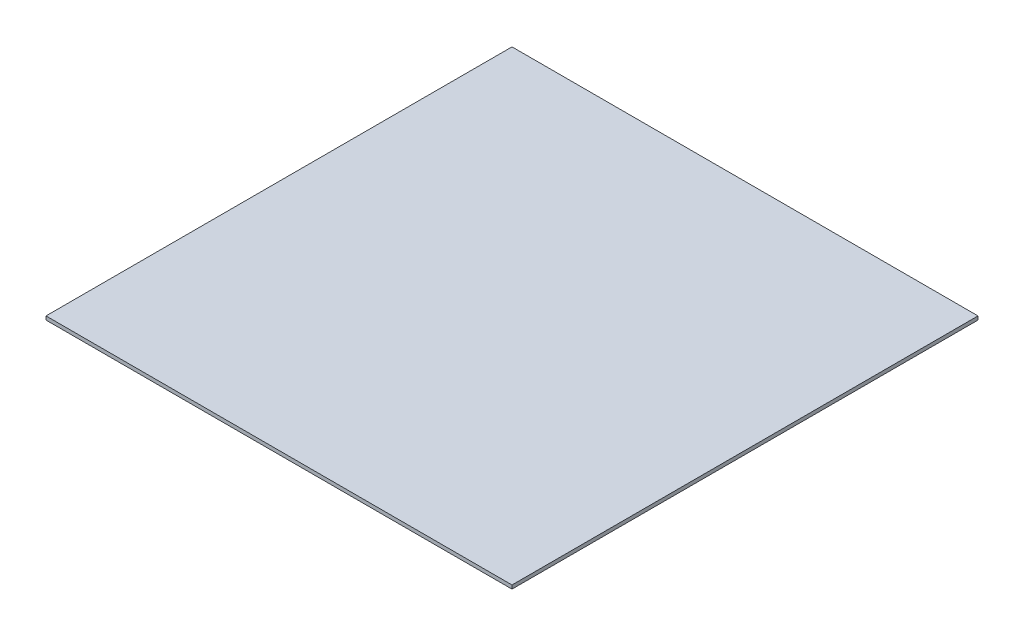
ISO-10303-21;
HEADER;
FILE_DESCRIPTION(('STEP AP214'),'2;1');
FILE_NAME('part.step','',(''),(''),'','','');
FILE_SCHEMA(('AUTOMOTIVE_DESIGN { 1 0 10303 214 1 1 1 1 }'));
ENDSEC;
DATA;
#1=APPLICATION_CONTEXT('core data for automotive mechanical design processes');
#2=APPLICATION_PROTOCOL_DEFINITION('international standard','automotive_design',2000,#1);
#3=PRODUCT_CONTEXT('',#1,'mechanical');
#4=PRODUCT('Part','Part','',(#3));
#5=PRODUCT_RELATED_PRODUCT_CATEGORY('part','',(#4));
#6=PRODUCT_DEFINITION_FORMATION('','',#4);
#7=PRODUCT_DEFINITION_CONTEXT('part definition',#1,'design');
#8=PRODUCT_DEFINITION('design','',#6,#7);
#9=PRODUCT_DEFINITION_SHAPE('','',#8);
#10=(LENGTH_UNIT() NAMED_UNIT(*) SI_UNIT(.MILLI.,.METRE.));
#11=(NAMED_UNIT(*) PLANE_ANGLE_UNIT() SI_UNIT($,.RADIAN.));
#12=(NAMED_UNIT(*) SI_UNIT($,.STERADIAN.) SOLID_ANGLE_UNIT());
#13=UNCERTAINTY_MEASURE_WITH_UNIT(LENGTH_MEASURE(1.E-05),#10,'distance_accuracy_value','');
#14=(GEOMETRIC_REPRESENTATION_CONTEXT(3) GLOBAL_UNCERTAINTY_ASSIGNED_CONTEXT((#13)) GLOBAL_UNIT_ASSIGNED_CONTEXT((#10,
#11,#12)) REPRESENTATION_CONTEXT('',''));
#15=CARTESIAN_POINT('',(0.,0.,0.));
#16=DIRECTION('',(0.,0.,1.));
#17=DIRECTION('',(1.,0.,0.));
#18=AXIS2_PLACEMENT_3D('',#15,#16,#17);
#19=CARTESIAN_POINT('',(640.638743755012,10.,640.638743755012));
#20=DIRECTION('',(-1.,0.,0.));
#21=DIRECTION('',(0.,0.,1.));
#22=AXIS2_PLACEMENT_3D('',#19,#20,#21);
#23=PLANE('',#22);
#24=DIRECTION('',(0.,0.,-1.));
#25=VECTOR('',#24,1.);
#26=CARTESIAN_POINT('',(640.638743755012,0.,640.638743755012));
#27=LINE('',#26,#25);
#28=CARTESIAN_POINT('',(640.638743755012,0.,640.638743755012));
#29=VERTEX_POINT('',#28);
#30=CARTESIAN_POINT('',(640.638743755012,0.,-640.638743755012));
#31=VERTEX_POINT('',#30);
#32=EDGE_CURVE('E98',#29,#31,#27,.T.);
#33=ORIENTED_EDGE('',*,*,#32,.T.);
#34=DIRECTION('',(0.,-1.,0.));
#35=VECTOR('',#34,1.);
#36=CARTESIAN_POINT('',(640.638743755012,10.,-640.638743755012));
#37=LINE('',#36,#35);
#38=CARTESIAN_POINT('',(640.638743755012,10.,-640.638743755012));
#39=VERTEX_POINT('',#38);
#40=EDGE_CURVE('E11',#39,#31,#37,.T.);
#41=ORIENTED_EDGE('',*,*,#40,.F.);
#42=DIRECTION('',(0.,0.,-1.));
#43=VECTOR('',#42,1.);
#44=CARTESIAN_POINT('',(640.638743755012,10.,640.638743755012));
#45=LINE('',#44,#43);
#46=CARTESIAN_POINT('',(640.638743755012,10.,640.638743755012));
#47=VERTEX_POINT('',#46);
#48=EDGE_CURVE('E86',#47,#39,#45,.T.);
#49=ORIENTED_EDGE('',*,*,#48,.F.);
#50=DIRECTION('',(0.,-1.,0.));
#51=VECTOR('',#50,1.);
#52=CARTESIAN_POINT('',(640.638743755012,10.,640.638743755012));
#53=LINE('',#52,#51);
#54=EDGE_CURVE('E94',#47,#29,#53,.T.);
#55=ORIENTED_EDGE('',*,*,#54,.T.);
#56=EDGE_LOOP('',(#33,#41,#49,#55));
#57=FACE_BOUND('',#56,.T.);
#58=ADVANCED_FACE('F35',(#57),#23,.F.);
#59=CARTESIAN_POINT('',(640.638743755012,10.,-640.638743755012));
#60=DIRECTION('',(0.,0.,1.));
#61=DIRECTION('',(1.,0.,0.));
#62=AXIS2_PLACEMENT_3D('',#59,#60,#61);
#63=PLANE('',#62);
#64=DIRECTION('',(-1.,0.,0.));
#65=VECTOR('',#64,1.);
#66=CARTESIAN_POINT('',(640.638743755012,0.,-640.638743755012));
#67=LINE('',#66,#65);
#68=CARTESIAN_POINT('',(-640.638743755012,0.,-640.638743755012));
#69=VERTEX_POINT('',#68);
#70=EDGE_CURVE('E90',#31,#69,#67,.T.);
#71=ORIENTED_EDGE('',*,*,#70,.T.);
#72=DIRECTION('',(0.,-1.,0.));
#73=VECTOR('',#72,1.);
#74=CARTESIAN_POINT('',(-640.638743755012,10.,-640.638743755012));
#75=LINE('',#74,#73);
#76=CARTESIAN_POINT('',(-640.638743755012,10.,-640.638743755012));
#77=VERTEX_POINT('',#76);
#78=EDGE_CURVE('E43',#77,#69,#75,.T.);
#79=ORIENTED_EDGE('',*,*,#78,.F.);
#80=DIRECTION('',(-1.,0.,0.));
#81=VECTOR('',#80,1.);
#82=CARTESIAN_POINT('',(640.638743755012,10.,-640.638743755012));
#83=LINE('',#82,#81);
#84=EDGE_CURVE('E81',#39,#77,#83,.T.);
#85=ORIENTED_EDGE('',*,*,#84,.F.);
#86=ORIENTED_EDGE('',*,*,#40,.T.);
#87=EDGE_LOOP('',(#71,#79,#85,#86));
#88=FACE_BOUND('',#87,.T.);
#89=ADVANCED_FACE('F89',(#88),#63,.F.);
#90=CARTESIAN_POINT('',(-640.638743755012,10.,-640.638743755012));
#91=DIRECTION('',(1.,0.,0.));
#92=DIRECTION('',(0.,0.,-1.));
#93=AXIS2_PLACEMENT_3D('',#90,#91,#92);
#94=PLANE('',#93);
#95=DIRECTION('',(0.,0.,1.));
#96=VECTOR('',#95,1.);
#97=CARTESIAN_POINT('',(-640.638743755012,0.,-640.638743755012));
#98=LINE('',#97,#96);
#99=CARTESIAN_POINT('',(-640.638743755012,0.,640.638743755012));
#100=VERTEX_POINT('',#99);
#101=EDGE_CURVE('E68',#69,#100,#98,.T.);
#102=ORIENTED_EDGE('',*,*,#101,.T.);
#103=DIRECTION('',(0.,-1.,0.));
#104=VECTOR('',#103,1.);
#105=CARTESIAN_POINT('',(-640.638743755012,10.,640.638743755012));
#106=LINE('',#105,#104);
#107=CARTESIAN_POINT('',(-640.638743755012,10.,640.638743755012));
#108=VERTEX_POINT('',#107);
#109=EDGE_CURVE('E91',#108,#100,#106,.T.);
#110=ORIENTED_EDGE('',*,*,#109,.F.);
#111=DIRECTION('',(0.,0.,1.));
#112=VECTOR('',#111,1.);
#113=CARTESIAN_POINT('',(-640.638743755012,10.,-640.638743755012));
#114=LINE('',#113,#112);
#115=EDGE_CURVE('E84',#77,#108,#114,.T.);
#116=ORIENTED_EDGE('',*,*,#115,.F.);
#117=ORIENTED_EDGE('',*,*,#78,.T.);
#118=EDGE_LOOP('',(#102,#110,#116,#117));
#119=FACE_BOUND('',#118,.T.);
#120=ADVANCED_FACE('F92',(#119),#94,.F.);
#121=CARTESIAN_POINT('',(-640.638743755012,10.,640.638743755012));
#122=DIRECTION('',(0.,0.,-1.));
#123=DIRECTION('',(-1.,0.,0.));
#124=AXIS2_PLACEMENT_3D('',#121,#122,#123);
#125=PLANE('',#124);
#126=DIRECTION('',(1.,0.,0.));
#127=VECTOR('',#126,1.);
#128=CARTESIAN_POINT('',(-640.638743755012,0.,640.638743755012));
#129=LINE('',#128,#127);
#130=EDGE_CURVE('E74',#100,#29,#129,.T.);
#131=ORIENTED_EDGE('',*,*,#130,.T.);
#132=ORIENTED_EDGE('',*,*,#54,.F.);
#133=DIRECTION('',(1.,0.,0.));
#134=VECTOR('',#133,1.);
#135=CARTESIAN_POINT('',(-640.638743755012,10.,640.638743755012));
#136=LINE('',#135,#134);
#137=EDGE_CURVE('E51',#108,#47,#136,.T.);
#138=ORIENTED_EDGE('',*,*,#137,.F.);
#139=ORIENTED_EDGE('',*,*,#109,.T.);
#140=EDGE_LOOP('',(#131,#132,#138,#139));
#141=FACE_BOUND('',#140,.T.);
#142=ADVANCED_FACE('F105',(#141),#125,.F.);
#143=CARTESIAN_POINT('',(0.,10.,0.));
#144=DIRECTION('',(0.,1.,0.));
#145=DIRECTION('',(0.,0.,1.));
#146=AXIS2_PLACEMENT_3D('',#143,#144,#145);
#147=PLANE('',#146);
#148=ORIENTED_EDGE('',*,*,#48,.T.);
#149=ORIENTED_EDGE('',*,*,#84,.T.);
#150=ORIENTED_EDGE('',*,*,#115,.T.);
#151=ORIENTED_EDGE('',*,*,#137,.T.);
#152=EDGE_LOOP('',(#148,#149,#150,#151));
#153=FACE_BOUND('',#152,.T.);
#154=ADVANCED_FACE('F82',(#153),#147,.T.);
#155=CARTESIAN_POINT('',(0.,0.,0.));
#156=DIRECTION('',(0.,1.,0.));
#157=DIRECTION('',(0.,0.,1.));
#158=AXIS2_PLACEMENT_3D('',#155,#156,#157);
#159=PLANE('',#158);
#160=ORIENTED_EDGE('',*,*,#32,.F.);
#161=ORIENTED_EDGE('',*,*,#130,.F.);
#162=ORIENTED_EDGE('',*,*,#101,.F.);
#163=ORIENTED_EDGE('',*,*,#70,.F.);
#164=EDGE_LOOP('',(#160,#161,#162,#163));
#165=FACE_BOUND('',#164,.T.);
#166=ADVANCED_FACE('F108',(#165),#159,.F.);
#167=CLOSED_SHELL('',(#58,#89,#120,#142,#154,#166));
#168=MANIFOLD_SOLID_BREP('B2',#167);
#169=ADVANCED_BREP_SHAPE_REPRESENTATION('',(#18,#168),#14);
#170=SHAPE_DEFINITION_REPRESENTATION(#9,#169);
ENDSEC;
END-ISO-10303-21;
